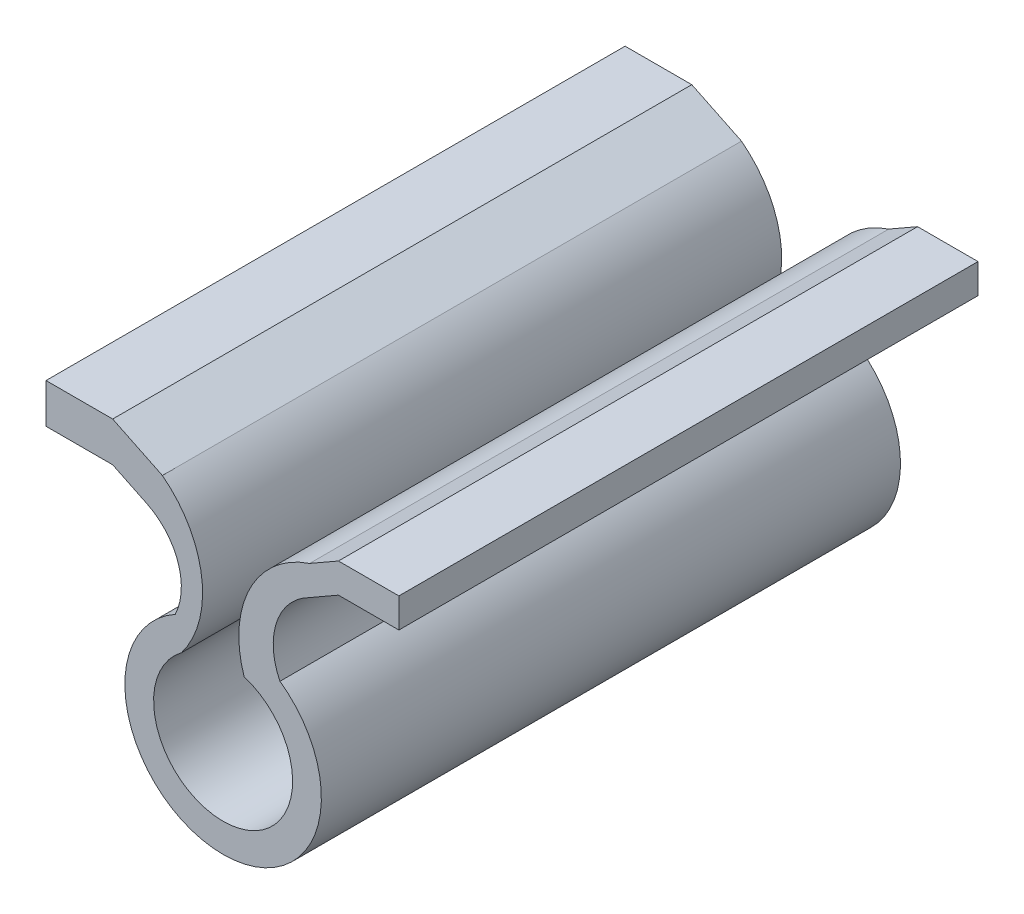
ISO-10303-21;
HEADER;
FILE_DESCRIPTION(('STEP AP214'),'2;1');
FILE_NAME('part.step','',(''),(''),'','','');
FILE_SCHEMA(('AUTOMOTIVE_DESIGN { 1 0 10303 214 1 1 1 1 }'));
ENDSEC;
DATA;
#1=APPLICATION_CONTEXT('core data for automotive mechanical design processes');
#2=APPLICATION_PROTOCOL_DEFINITION('international standard','automotive_design',2000,#1);
#3=PRODUCT_CONTEXT('',#1,'mechanical');
#4=PRODUCT('Part','Part','',(#3));
#5=PRODUCT_RELATED_PRODUCT_CATEGORY('part','',(#4));
#6=PRODUCT_DEFINITION_FORMATION('','',#4);
#7=PRODUCT_DEFINITION_CONTEXT('part definition',#1,'design');
#8=PRODUCT_DEFINITION('design','',#6,#7);
#9=PRODUCT_DEFINITION_SHAPE('','',#8);
#10=(LENGTH_UNIT() NAMED_UNIT(*) SI_UNIT(.MILLI.,.METRE.));
#11=(NAMED_UNIT(*) PLANE_ANGLE_UNIT() SI_UNIT($,.RADIAN.));
#12=(NAMED_UNIT(*) SI_UNIT($,.STERADIAN.) SOLID_ANGLE_UNIT());
#13=UNCERTAINTY_MEASURE_WITH_UNIT(LENGTH_MEASURE(1.E-05),#10,'distance_accuracy_value','');
#14=(GEOMETRIC_REPRESENTATION_CONTEXT(3) GLOBAL_UNCERTAINTY_ASSIGNED_CONTEXT((#13)) GLOBAL_UNIT_ASSIGNED_CONTEXT((#10,
#11,#12)) REPRESENTATION_CONTEXT('',''));
#15=CARTESIAN_POINT('',(0.,0.,0.));
#16=DIRECTION('',(0.,0.,1.));
#17=DIRECTION('',(1.,0.,0.));
#18=AXIS2_PLACEMENT_3D('',#15,#16,#17);
#19=CARTESIAN_POINT('',(-8.88655130802886,9.70742429222513,-50.));
#20=DIRECTION('',(0.,0.,1.));
#21=DIRECTION('',(1.,0.,0.));
#22=AXIS2_PLACEMENT_3D('',#19,#20,#21);
#23=CYLINDRICAL_SURFACE('',#22,5.27994745300308);
#24=CARTESIAN_POINT('',(-8.88655130802886,9.70742429222513,0.));
#25=DIRECTION('',(0.,0.,-1.));
#26=DIRECTION('',(1.,0.,0.));
#27=AXIS2_PLACEMENT_3D('',#24,#25,#26);
#28=CIRCLE('',#27,5.27994745300308);
#29=CARTESIAN_POINT('',(-6.58660829445862,14.4601190268786,0.));
#30=VERTEX_POINT('',#29);
#31=CARTESIAN_POINT('',(-4.13385657337527,7.40748127865506,0.));
#32=VERTEX_POINT('',#31);
#33=EDGE_CURVE('E178',#30,#32,#28,.T.);
#34=ORIENTED_EDGE('',*,*,#33,.F.);
#35=DIRECTION('',(0.,0.,1.));
#36=VECTOR('',#35,1.);
#37=CARTESIAN_POINT('',(-6.58660829445862,14.4601190268786,-50.));
#38=LINE('',#37,#36);
#39=CARTESIAN_POINT('',(-6.58660829445862,14.4601190268786,-50.));
#40=VERTEX_POINT('',#39);
#41=EDGE_CURVE('E11',#40,#30,#38,.T.);
#42=ORIENTED_EDGE('',*,*,#41,.F.);
#43=CARTESIAN_POINT('',(-8.88655130802886,9.70742429222513,-50.));
#44=DIRECTION('',(0.,0.,-1.));
#45=DIRECTION('',(1.,0.,0.));
#46=AXIS2_PLACEMENT_3D('',#43,#44,#45);
#47=CIRCLE('',#46,5.27994745300308);
#48=CARTESIAN_POINT('',(-4.13385657337527,7.40748127865506,-50.));
#49=VERTEX_POINT('',#48);
#50=EDGE_CURVE('E222',#40,#49,#47,.T.);
#51=ORIENTED_EDGE('',*,*,#50,.T.);
#52=DIRECTION('',(0.,0.,1.));
#53=VECTOR('',#52,1.);
#54=CARTESIAN_POINT('',(-4.13385657337527,7.40748127865506,-50.));
#55=LINE('',#54,#53);
#56=EDGE_CURVE('E36',#49,#32,#55,.T.);
#57=ORIENTED_EDGE('',*,*,#56,.T.);
#58=EDGE_LOOP('',(#34,#42,#51,#57));
#59=FACE_BOUND('',#58,.T.);
#60=ADVANCED_FACE('F33',(#59),#23,.F.);
#61=CARTESIAN_POINT('',(-6.58660829445862,14.4601190268786,-50.));
#62=DIRECTION('',(-0.435599602844931,-0.90014053680597,0.));
#63=DIRECTION('',(0.90014053680597,-0.435599602844931,0.));
#64=AXIS2_PLACEMENT_3D('',#61,#62,#63);
#65=PLANE('',#64);
#66=DIRECTION('',(0.90014053680597,-0.435599602844931,0.));
#67=VECTOR('',#66,1.);
#68=CARTESIAN_POINT('',(-6.58660829445862,14.4601190268786,0.));
#69=LINE('',#68,#67);
#70=CARTESIAN_POINT('',(-9.53478421620011,15.8868120910356,0.));
#71=VERTEX_POINT('',#70);
#72=EDGE_CURVE('E220',#71,#30,#69,.T.);
#73=ORIENTED_EDGE('',*,*,#72,.F.);
#74=DIRECTION('',(0.,0.,1.));
#75=VECTOR('',#74,1.);
#76=CARTESIAN_POINT('',(-9.53478421620011,15.8868120910356,-50.));
#77=LINE('',#76,#75);
#78=CARTESIAN_POINT('',(-9.53478421620011,15.8868120910356,-50.));
#79=VERTEX_POINT('',#78);
#80=EDGE_CURVE('E42',#79,#71,#77,.T.);
#81=ORIENTED_EDGE('',*,*,#80,.F.);
#82=DIRECTION('',(0.90014053680597,-0.435599602844931,0.));
#83=VECTOR('',#82,1.);
#84=CARTESIAN_POINT('',(-6.58660829445862,14.4601190268786,-50.));
#85=LINE('',#84,#83);
#86=EDGE_CURVE('E168',#79,#40,#85,.T.);
#87=ORIENTED_EDGE('',*,*,#86,.T.);
#88=ORIENTED_EDGE('',*,*,#41,.T.);
#89=EDGE_LOOP('',(#73,#81,#87,#88));
#90=FACE_BOUND('',#89,.T.);
#91=ADVANCED_FACE('F250',(#90),#65,.T.);
#92=CARTESIAN_POINT('',(-9.53478421620011,15.8868120910356,-50.));
#93=DIRECTION('',(0.,-1.,0.));
#94=DIRECTION('',(0.,0.,-1.));
#95=AXIS2_PLACEMENT_3D('',#92,#93,#94);
#96=PLANE('',#95);
#97=DIRECTION('',(1.,0.,0.));
#98=VECTOR('',#97,1.);
#99=CARTESIAN_POINT('',(-9.53478421620011,15.8868120910356,0.));
#100=LINE('',#99,#98);
#101=CARTESIAN_POINT('',(-15.2917008969375,15.8868120910356,0.));
#102=VERTEX_POINT('',#101);
#103=EDGE_CURVE('E155',#102,#71,#100,.T.);
#104=ORIENTED_EDGE('',*,*,#103,.F.);
#105=DIRECTION('',(0.,0.,1.));
#106=VECTOR('',#105,1.);
#107=CARTESIAN_POINT('',(-15.2917008969375,15.8868120910356,-50.));
#108=LINE('',#107,#106);
#109=CARTESIAN_POINT('',(-15.2917008969375,15.8868120910356,-50.));
#110=VERTEX_POINT('',#109);
#111=EDGE_CURVE('E150',#110,#102,#108,.T.);
#112=ORIENTED_EDGE('',*,*,#111,.F.);
#113=DIRECTION('',(1.,0.,0.));
#114=VECTOR('',#113,1.);
#115=CARTESIAN_POINT('',(-9.53478421620011,15.8868120910356,-50.));
#116=LINE('',#115,#114);
#117=EDGE_CURVE('E153',#110,#79,#116,.T.);
#118=ORIENTED_EDGE('',*,*,#117,.T.);
#119=ORIENTED_EDGE('',*,*,#80,.T.);
#120=EDGE_LOOP('',(#104,#112,#118,#119));
#121=FACE_BOUND('',#120,.T.);
#122=ADVANCED_FACE('F152',(#121),#96,.T.);
#123=CARTESIAN_POINT('',(-15.2917008969375,15.8868120910356,-50.));
#124=DIRECTION('',(-1.,0.,0.));
#125=DIRECTION('',(0.,0.,1.));
#126=AXIS2_PLACEMENT_3D('',#123,#124,#125);
#127=PLANE('',#126);
#128=DIRECTION('',(0.,-1.,0.));
#129=VECTOR('',#128,1.);
#130=CARTESIAN_POINT('',(-15.2917008969375,15.8868120910356,0.));
#131=LINE('',#130,#129);
#132=CARTESIAN_POINT('',(-15.2917008969375,19.3100991911169,0.));
#133=VERTEX_POINT('',#132);
#134=EDGE_CURVE('E217',#133,#102,#131,.T.);
#135=ORIENTED_EDGE('',*,*,#134,.F.);
#136=DIRECTION('',(0.,0.,1.));
#137=VECTOR('',#136,1.);
#138=CARTESIAN_POINT('',(-15.2917008969375,19.3100991911169,-50.));
#139=LINE('',#138,#137);
#140=CARTESIAN_POINT('',(-15.2917008969375,19.3100991911169,-50.));
#141=VERTEX_POINT('',#140);
#142=EDGE_CURVE('E160',#141,#133,#139,.T.);
#143=ORIENTED_EDGE('',*,*,#142,.F.);
#144=DIRECTION('',(0.,-1.,0.));
#145=VECTOR('',#144,1.);
#146=CARTESIAN_POINT('',(-15.2917008969375,15.8868120910356,-50.));
#147=LINE('',#146,#145);
#148=EDGE_CURVE('E166',#141,#110,#147,.T.);
#149=ORIENTED_EDGE('',*,*,#148,.T.);
#150=ORIENTED_EDGE('',*,*,#111,.T.);
#151=EDGE_LOOP('',(#135,#143,#149,#150));
#152=FACE_BOUND('',#151,.T.);
#153=ADVANCED_FACE('F170',(#152),#127,.T.);
#154=CARTESIAN_POINT('',(-15.2917008969375,19.3100991911169,-50.));
#155=DIRECTION('',(0.,1.,0.));
#156=DIRECTION('',(0.,0.,1.));
#157=AXIS2_PLACEMENT_3D('',#154,#155,#156);
#158=PLANE('',#157);
#159=DIRECTION('',(-1.,0.,0.));
#160=VECTOR('',#159,1.);
#161=CARTESIAN_POINT('',(-15.2917008969375,19.3100991911169,0.));
#162=LINE('',#161,#160);
#163=CARTESIAN_POINT('',(-9.53478421620011,19.3100991911169,0.));
#164=VERTEX_POINT('',#163);
#165=EDGE_CURVE('E214',#164,#133,#162,.T.);
#166=ORIENTED_EDGE('',*,*,#165,.F.);
#167=DIRECTION('',(0.,0.,1.));
#168=VECTOR('',#167,1.);
#169=CARTESIAN_POINT('',(-9.53478421620011,19.3100991911169,-50.));
#170=LINE('',#169,#168);
#171=CARTESIAN_POINT('',(-9.53478421620011,19.3100991911169,-50.));
#172=VERTEX_POINT('',#171);
#173=EDGE_CURVE('E226',#172,#164,#170,.T.);
#174=ORIENTED_EDGE('',*,*,#173,.F.);
#175=DIRECTION('',(-1.,0.,0.));
#176=VECTOR('',#175,1.);
#177=CARTESIAN_POINT('',(-15.2917008969375,19.3100991911169,-50.));
#178=LINE('',#177,#176);
#179=EDGE_CURVE('E171',#172,#141,#178,.T.);
#180=ORIENTED_EDGE('',*,*,#179,.T.);
#181=ORIENTED_EDGE('',*,*,#142,.T.);
#182=EDGE_LOOP('',(#166,#174,#180,#181));
#183=FACE_BOUND('',#182,.T.);
#184=ADVANCED_FACE('F263',(#183),#158,.T.);
#185=CARTESIAN_POINT('',(-9.53478421620011,19.3100991911169,-50.));
#186=DIRECTION('',(0.43559960284493,0.90014053680597,0.));
#187=DIRECTION('',(-0.90014053680597,0.43559960284493,0.));
#188=AXIS2_PLACEMENT_3D('',#185,#186,#187);
#189=PLANE('',#188);
#190=DIRECTION('',(-0.90014053680597,0.43559960284493,0.));
#191=VECTOR('',#190,1.);
#192=CARTESIAN_POINT('',(-9.53478421620011,19.3100991911169,0.));
#193=LINE('',#192,#191);
#194=CARTESIAN_POINT('',(-5.24433447733515,17.2338476216594,0.));
#195=VERTEX_POINT('',#194);
#196=EDGE_CURVE('E211',#195,#164,#193,.T.);
#197=ORIENTED_EDGE('',*,*,#196,.F.);
#198=DIRECTION('',(0.,0.,1.));
#199=VECTOR('',#198,1.);
#200=CARTESIAN_POINT('',(-5.24433447733515,17.2338476216594,-50.));
#201=LINE('',#200,#199);
#202=CARTESIAN_POINT('',(-5.24433447733515,17.2338476216594,-50.));
#203=VERTEX_POINT('',#202);
#204=EDGE_CURVE('E228',#203,#195,#201,.T.);
#205=ORIENTED_EDGE('',*,*,#204,.F.);
#206=DIRECTION('',(-0.90014053680597,0.43559960284493,0.));
#207=VECTOR('',#206,1.);
#208=CARTESIAN_POINT('',(-9.53478421620011,19.3100991911169,-50.));
#209=LINE('',#208,#207);
#210=EDGE_CURVE('E173',#203,#172,#209,.T.);
#211=ORIENTED_EDGE('',*,*,#210,.T.);
#212=ORIENTED_EDGE('',*,*,#173,.T.);
#213=EDGE_LOOP('',(#197,#205,#211,#212));
#214=FACE_BOUND('',#213,.T.);
#215=ADVANCED_FACE('F266',(#214),#189,.T.);
#216=CARTESIAN_POINT('',(-10.6448729753776,10.1955785013076,-50.));
#217=DIRECTION('',(0.,0.,1.));
#218=DIRECTION('',(1.,0.,0.));
#219=AXIS2_PLACEMENT_3D('',#216,#217,#218);
#220=CYLINDRICAL_SURFACE('',#219,8.87147385045668);
#221=CARTESIAN_POINT('',(-10.6448729753776,10.1955785013076,0.));
#222=DIRECTION('',(0.,0.,1.));
#223=DIRECTION('',(-1.,0.,0.));
#224=AXIS2_PLACEMENT_3D('',#221,#222,#223);
#225=CIRCLE('',#224,8.87147385045668);
#226=CARTESIAN_POINT('',(-3.60660385502578,4.79504000326516,0.));
#227=VERTEX_POINT('',#226);
#228=EDGE_CURVE('E208',#227,#195,#225,.T.);
#229=ORIENTED_EDGE('',*,*,#228,.F.);
#230=DIRECTION('',(0.,0.,1.));
#231=VECTOR('',#230,1.);
#232=CARTESIAN_POINT('',(-3.60660385502578,4.79504000326516,-50.));
#233=LINE('',#232,#231);
#234=CARTESIAN_POINT('',(-3.60660385502578,4.79504000326516,-50.));
#235=VERTEX_POINT('',#234);
#236=EDGE_CURVE('E230',#235,#227,#233,.T.);
#237=ORIENTED_EDGE('',*,*,#236,.F.);
#238=CARTESIAN_POINT('',(-10.6448729753776,10.1955785013076,-50.));
#239=DIRECTION('',(0.,0.,1.));
#240=DIRECTION('',(-1.,0.,0.));
#241=AXIS2_PLACEMENT_3D('',#238,#239,#240);
#242=CIRCLE('',#241,8.87147385045668);
#243=EDGE_CURVE('E447',#235,#203,#242,.T.);
#244=ORIENTED_EDGE('',*,*,#243,.T.);
#245=ORIENTED_EDGE('',*,*,#204,.T.);
#246=EDGE_LOOP('',(#229,#237,#244,#245));
#247=FACE_BOUND('',#246,.T.);
#248=ADVANCED_FACE('F270',(#247),#220,.T.);
#249=CARTESIAN_POINT('',(0.,0.,-50.));
#250=DIRECTION('',(0.,0.,1.));
#251=DIRECTION('',(1.,0.,0.));
#252=AXIS2_PLACEMENT_3D('',#249,#250,#251);
#253=CYLINDRICAL_SURFACE('',#252,6.);
#254=CARTESIAN_POINT('',(0.,0.,0.));
#255=DIRECTION('',(0.,0.,-1.));
#256=DIRECTION('',(1.,0.,0.));
#257=AXIS2_PLACEMENT_3D('',#254,#255,#256);
#258=CIRCLE('',#257,6.);
#259=CARTESIAN_POINT('',(1.81186461489304,5.71989043752575,0.));
#260=VERTEX_POINT('',#259);
#261=EDGE_CURVE('E205',#260,#227,#258,.T.);
#262=ORIENTED_EDGE('',*,*,#261,.F.);
#263=DIRECTION('',(0.,0.,1.));
#264=VECTOR('',#263,1.);
#265=CARTESIAN_POINT('',(1.81186461489304,5.71989043752575,-50.));
#266=LINE('',#265,#264);
#267=CARTESIAN_POINT('',(1.81186461489304,5.71989043752575,-50.));
#268=VERTEX_POINT('',#267);
#269=EDGE_CURVE('E232',#268,#260,#266,.T.);
#270=ORIENTED_EDGE('',*,*,#269,.F.);
#271=CARTESIAN_POINT('',(0.,0.,-50.));
#272=DIRECTION('',(0.,0.,-1.));
#273=DIRECTION('',(1.,0.,0.));
#274=AXIS2_PLACEMENT_3D('',#271,#272,#273);
#275=CIRCLE('',#274,6.);
#276=EDGE_CURVE('E443',#268,#235,#275,.T.);
#277=ORIENTED_EDGE('',*,*,#276,.T.);
#278=ORIENTED_EDGE('',*,*,#236,.T.);
#279=EDGE_LOOP('',(#262,#270,#277,#278));
#280=FACE_BOUND('',#279,.T.);
#281=ADVANCED_FACE('F274',(#280),#253,.F.);
#282=CARTESIAN_POINT('',(10.2853846896685,8.53937679193668,-50.));
#283=DIRECTION('',(0.,0.,1.));
#284=DIRECTION('',(1.,0.,0.));
#285=AXIS2_PLACEMENT_3D('',#282,#283,#284);
#286=CYLINDRICAL_SURFACE('',#285,8.93028811183223);
#287=CARTESIAN_POINT('',(10.2853846896685,8.53937679193668,0.));
#288=DIRECTION('',(0.,0.,1.));
#289=DIRECTION('',(1.,0.,0.));
#290=AXIS2_PLACEMENT_3D('',#287,#288,#289);
#291=CIRCLE('',#290,8.93028811183223);
#292=CARTESIAN_POINT('',(7.46589833525728,17.012896866712,0.));
#293=VERTEX_POINT('',#292);
#294=EDGE_CURVE('E202',#293,#260,#291,.T.);
#295=ORIENTED_EDGE('',*,*,#294,.F.);
#296=DIRECTION('',(0.,0.,1.));
#297=VECTOR('',#296,1.);
#298=CARTESIAN_POINT('',(7.46589833525728,17.012896866712,-50.));
#299=LINE('',#298,#297);
#300=CARTESIAN_POINT('',(7.46589833525728,17.012896866712,-50.));
#301=VERTEX_POINT('',#300);
#302=EDGE_CURVE('E234',#301,#293,#299,.T.);
#303=ORIENTED_EDGE('',*,*,#302,.F.);
#304=CARTESIAN_POINT('',(10.2853846896685,8.53937679193668,-50.));
#305=DIRECTION('',(0.,0.,1.));
#306=DIRECTION('',(1.,0.,0.));
#307=AXIS2_PLACEMENT_3D('',#304,#305,#306);
#308=CIRCLE('',#307,8.93028811183223);
#309=EDGE_CURVE('E454',#301,#268,#308,.T.);
#310=ORIENTED_EDGE('',*,*,#309,.T.);
#311=ORIENTED_EDGE('',*,*,#269,.T.);
#312=EDGE_LOOP('',(#295,#303,#310,#311));
#313=FACE_BOUND('',#312,.T.);
#314=ADVANCED_FACE('F278',(#313),#286,.T.);
#315=CARTESIAN_POINT('',(9.95662893744976,18.439589930869,-50.));
#316=DIRECTION('',(-0.49703644842418,0.867729663511556,0.));
#317=DIRECTION('',(-0.867729663511556,-0.49703644842418,0.));
#318=AXIS2_PLACEMENT_3D('',#315,#316,#317);
#319=PLANE('',#318);
#320=DIRECTION('',(-0.867729663511555,-0.49703644842418,0.));
#321=VECTOR('',#320,1.);
#322=CARTESIAN_POINT('',(9.95662893744976,18.439589930869,0.));
#323=LINE('',#322,#321);
#324=CARTESIAN_POINT('',(9.95662893744976,18.439589930869,0.));
#325=VERTEX_POINT('',#324);
#326=EDGE_CURVE('E199',#325,#293,#323,.T.);
#327=ORIENTED_EDGE('',*,*,#326,.F.);
#328=DIRECTION('',(0.,0.,1.));
#329=VECTOR('',#328,1.);
#330=CARTESIAN_POINT('',(9.95662893744976,18.439589930869,-50.));
#331=LINE('',#330,#329);
#332=CARTESIAN_POINT('',(9.95662893744976,18.439589930869,-50.));
#333=VERTEX_POINT('',#332);
#334=EDGE_CURVE('E236',#333,#325,#331,.T.);
#335=ORIENTED_EDGE('',*,*,#334,.F.);
#336=DIRECTION('',(-0.867729663511555,-0.49703644842418,0.));
#337=VECTOR('',#336,1.);
#338=CARTESIAN_POINT('',(9.95662893744976,18.439589930869,-50.));
#339=LINE('',#338,#337);
#340=EDGE_CURVE('E436',#333,#301,#339,.T.);
#341=ORIENTED_EDGE('',*,*,#340,.T.);
#342=ORIENTED_EDGE('',*,*,#302,.T.);
#343=EDGE_LOOP('',(#327,#335,#341,#342));
#344=FACE_BOUND('',#343,.T.);
#345=ADVANCED_FACE('F282',(#344),#319,.T.);
#346=CARTESIAN_POINT('',(15.1761232117386,18.439589930869,-50.));
#347=DIRECTION('',(0.,1.,0.));
#348=DIRECTION('',(0.,0.,1.));
#349=AXIS2_PLACEMENT_3D('',#346,#347,#348);
#350=PLANE('',#349);
#351=DIRECTION('',(-1.,0.,0.));
#352=VECTOR('',#351,1.);
#353=CARTESIAN_POINT('',(15.1761232117386,18.439589930869,0.));
#354=LINE('',#353,#352);
#355=CARTESIAN_POINT('',(15.1761232117386,18.439589930869,0.));
#356=VERTEX_POINT('',#355);
#357=EDGE_CURVE('E196',#356,#325,#354,.T.);
#358=ORIENTED_EDGE('',*,*,#357,.F.);
#359=DIRECTION('',(0.,0.,1.));
#360=VECTOR('',#359,1.);
#361=CARTESIAN_POINT('',(15.1761232117386,18.439589930869,-50.));
#362=LINE('',#361,#360);
#363=CARTESIAN_POINT('',(15.1761232117386,18.439589930869,-50.));
#364=VERTEX_POINT('',#363);
#365=EDGE_CURVE('E238',#364,#356,#362,.T.);
#366=ORIENTED_EDGE('',*,*,#365,.F.);
#367=DIRECTION('',(-1.,0.,0.));
#368=VECTOR('',#367,1.);
#369=CARTESIAN_POINT('',(15.1761232117386,18.439589930869,-50.));
#370=LINE('',#369,#368);
#371=EDGE_CURVE('E432',#364,#333,#370,.T.);
#372=ORIENTED_EDGE('',*,*,#371,.T.);
#373=ORIENTED_EDGE('',*,*,#334,.T.);
#374=EDGE_LOOP('',(#358,#366,#372,#373));
#375=FACE_BOUND('',#374,.T.);
#376=ADVANCED_FACE('F286',(#375),#350,.T.);
#377=CARTESIAN_POINT('',(15.1761232117386,15.8868120910356,-50.));
#378=DIRECTION('',(1.,0.,0.));
#379=DIRECTION('',(0.,0.,-1.));
#380=AXIS2_PLACEMENT_3D('',#377,#378,#379);
#381=PLANE('',#380);
#382=DIRECTION('',(0.,1.,0.));
#383=VECTOR('',#382,1.);
#384=CARTESIAN_POINT('',(15.1761232117386,15.8868120910356,0.));
#385=LINE('',#384,#383);
#386=CARTESIAN_POINT('',(15.1761232117386,15.8868120910356,0.));
#387=VERTEX_POINT('',#386);
#388=EDGE_CURVE('E193',#387,#356,#385,.T.);
#389=ORIENTED_EDGE('',*,*,#388,.F.);
#390=DIRECTION('',(0.,0.,1.));
#391=VECTOR('',#390,1.);
#392=CARTESIAN_POINT('',(15.1761232117386,15.8868120910356,-50.));
#393=LINE('',#392,#391);
#394=CARTESIAN_POINT('',(15.1761232117386,15.8868120910356,-50.));
#395=VERTEX_POINT('',#394);
#396=EDGE_CURVE('E240',#395,#387,#393,.T.);
#397=ORIENTED_EDGE('',*,*,#396,.F.);
#398=DIRECTION('',(0.,1.,0.));
#399=VECTOR('',#398,1.);
#400=CARTESIAN_POINT('',(15.1761232117386,15.8868120910356,-50.));
#401=LINE('',#400,#399);
#402=EDGE_CURVE('E458',#395,#364,#401,.T.);
#403=ORIENTED_EDGE('',*,*,#402,.T.);
#404=ORIENTED_EDGE('',*,*,#365,.T.);
#405=EDGE_LOOP('',(#389,#397,#403,#404));
#406=FACE_BOUND('',#405,.T.);
#407=ADVANCED_FACE('F290',(#406),#381,.T.);
#408=CARTESIAN_POINT('',(9.95662893744976,15.8868120910356,-50.));
#409=DIRECTION('',(0.,-1.,0.));
#410=DIRECTION('',(0.,0.,-1.));
#411=AXIS2_PLACEMENT_3D('',#408,#409,#410);
#412=PLANE('',#411);
#413=DIRECTION('',(1.,0.,0.));
#414=VECTOR('',#413,1.);
#415=CARTESIAN_POINT('',(9.95662893744976,15.8868120910356,0.));
#416=LINE('',#415,#414);
#417=CARTESIAN_POINT('',(9.95662893744976,15.8868120910356,0.));
#418=VERTEX_POINT('',#417);
#419=EDGE_CURVE('E190',#418,#387,#416,.T.);
#420=ORIENTED_EDGE('',*,*,#419,.F.);
#421=DIRECTION('',(0.,0.,1.));
#422=VECTOR('',#421,1.);
#423=CARTESIAN_POINT('',(9.95662893744976,15.8868120910356,-50.));
#424=LINE('',#423,#422);
#425=CARTESIAN_POINT('',(9.95662893744976,15.8868120910356,-50.));
#426=VERTEX_POINT('',#425);
#427=EDGE_CURVE('E242',#426,#418,#424,.T.);
#428=ORIENTED_EDGE('',*,*,#427,.F.);
#429=DIRECTION('',(1.,0.,0.));
#430=VECTOR('',#429,1.);
#431=CARTESIAN_POINT('',(9.95662893744976,15.8868120910356,-50.));
#432=LINE('',#431,#430);
#433=EDGE_CURVE('E425',#426,#395,#432,.T.);
#434=ORIENTED_EDGE('',*,*,#433,.T.);
#435=ORIENTED_EDGE('',*,*,#396,.T.);
#436=EDGE_LOOP('',(#420,#428,#434,#435));
#437=FACE_BOUND('',#436,.T.);
#438=ADVANCED_FACE('F294',(#437),#412,.T.);
#439=CARTESIAN_POINT('',(7.46589833525728,14.4601190268786,-50.));
#440=DIRECTION('',(0.49703644842418,-0.867729663511556,0.));
#441=DIRECTION('',(0.867729663511556,0.49703644842418,0.));
#442=AXIS2_PLACEMENT_3D('',#439,#440,#441);
#443=PLANE('',#442);
#444=DIRECTION('',(0.867729663511555,0.49703644842418,0.));
#445=VECTOR('',#444,1.);
#446=CARTESIAN_POINT('',(7.46589833525728,14.4601190268786,0.));
#447=LINE('',#446,#445);
#448=CARTESIAN_POINT('',(7.46589833525728,14.4601190268786,0.));
#449=VERTEX_POINT('',#448);
#450=EDGE_CURVE('E187',#449,#418,#447,.T.);
#451=ORIENTED_EDGE('',*,*,#450,.F.);
#452=DIRECTION('',(0.,0.,1.));
#453=VECTOR('',#452,1.);
#454=CARTESIAN_POINT('',(7.46589833525728,14.4601190268786,-50.));
#455=LINE('',#454,#453);
#456=CARTESIAN_POINT('',(7.46589833525728,14.4601190268786,-50.));
#457=VERTEX_POINT('',#456);
#458=EDGE_CURVE('E244',#457,#449,#455,.T.);
#459=ORIENTED_EDGE('',*,*,#458,.F.);
#460=DIRECTION('',(0.867729663511555,0.49703644842418,0.));
#461=VECTOR('',#460,1.);
#462=CARTESIAN_POINT('',(7.46589833525728,14.4601190268786,-50.));
#463=LINE('',#462,#461);
#464=EDGE_CURVE('E421',#457,#426,#463,.T.);
#465=ORIENTED_EDGE('',*,*,#464,.T.);
#466=ORIENTED_EDGE('',*,*,#427,.T.);
#467=EDGE_LOOP('',(#451,#459,#465,#466));
#468=FACE_BOUND('',#467,.T.);
#469=ADVANCED_FACE('F298',(#468),#443,.T.);
#470=CARTESIAN_POINT('',(9.95662893744976,9.41039829271164,-50.));
#471=DIRECTION('',(0.,0.,1.));
#472=DIRECTION('',(1.,0.,0.));
#473=AXIS2_PLACEMENT_3D('',#470,#471,#472);
#474=CYLINDRICAL_SURFACE('',#473,5.63057887128617);
#475=CARTESIAN_POINT('',(9.95662893744976,9.41039829271164,0.));
#476=DIRECTION('',(0.,0.,-1.));
#477=DIRECTION('',(-1.,0.,0.));
#478=AXIS2_PLACEMENT_3D('',#475,#476,#477);
#479=CIRCLE('',#478,5.63057887128617);
#480=CARTESIAN_POINT('',(4.90690820327153,6.91966769054192,0.));
#481=VERTEX_POINT('',#480);
#482=EDGE_CURVE('E184',#481,#449,#479,.T.);
#483=ORIENTED_EDGE('',*,*,#482,.F.);
#484=DIRECTION('',(0.,0.,1.));
#485=VECTOR('',#484,1.);
#486=CARTESIAN_POINT('',(4.90690820327153,6.91966769054192,-50.));
#487=LINE('',#486,#485);
#488=CARTESIAN_POINT('',(4.90690820327153,6.91966769054192,-50.));
#489=VERTEX_POINT('',#488);
#490=EDGE_CURVE('E245',#489,#481,#487,.T.);
#491=ORIENTED_EDGE('',*,*,#490,.F.);
#492=CARTESIAN_POINT('',(9.95662893744976,9.41039829271164,-50.));
#493=DIRECTION('',(0.,0.,-1.));
#494=DIRECTION('',(-1.,0.,0.));
#495=AXIS2_PLACEMENT_3D('',#492,#493,#494);
#496=CIRCLE('',#495,5.63057887128617);
#497=EDGE_CURVE('E462',#489,#457,#496,.T.);
#498=ORIENTED_EDGE('',*,*,#497,.T.);
#499=ORIENTED_EDGE('',*,*,#458,.T.);
#500=EDGE_LOOP('',(#483,#491,#498,#499));
#501=FACE_BOUND('',#500,.T.);
#502=ADVANCED_FACE('F302',(#501),#474,.F.);
#503=CARTESIAN_POINT('',(0.,0.,-50.));
#504=DIRECTION('',(0.,0.,1.));
#505=DIRECTION('',(1.,0.,0.));
#506=AXIS2_PLACEMENT_3D('',#503,#504,#505);
#507=CYLINDRICAL_SURFACE('',#506,8.48289744502804);
#508=CARTESIAN_POINT('',(0.,0.,0.));
#509=DIRECTION('',(0.,0.,1.));
#510=DIRECTION('',(1.,0.,0.));
#511=AXIS2_PLACEMENT_3D('',#508,#509,#510);
#512=CIRCLE('',#511,8.48289744502804);
#513=EDGE_CURVE('E181',#32,#481,#512,.T.);
#514=ORIENTED_EDGE('',*,*,#513,.F.);
#515=ORIENTED_EDGE('',*,*,#56,.F.);
#516=CARTESIAN_POINT('',(0.,0.,-50.));
#517=DIRECTION('',(0.,0.,1.));
#518=DIRECTION('',(1.,0.,0.));
#519=AXIS2_PLACEMENT_3D('',#516,#517,#518);
#520=CIRCLE('',#519,8.48289744502804);
#521=EDGE_CURVE('E464',#49,#489,#520,.T.);
#522=ORIENTED_EDGE('',*,*,#521,.T.);
#523=ORIENTED_EDGE('',*,*,#490,.T.);
#524=EDGE_LOOP('',(#514,#515,#522,#523));
#525=FACE_BOUND('',#524,.T.);
#526=ADVANCED_FACE('F247',(#525),#507,.T.);
#527=CARTESIAN_POINT('',(-8.88655130802886,9.70742429222513,-50.));
#528=DIRECTION('',(0.,0.,1.));
#529=DIRECTION('',(1.,0.,0.));
#530=AXIS2_PLACEMENT_3D('',#527,#528,#529);
#531=PLANE('',#530);
#532=ORIENTED_EDGE('',*,*,#50,.F.);
#533=ORIENTED_EDGE('',*,*,#86,.F.);
#534=ORIENTED_EDGE('',*,*,#117,.F.);
#535=ORIENTED_EDGE('',*,*,#148,.F.);
#536=ORIENTED_EDGE('',*,*,#179,.F.);
#537=ORIENTED_EDGE('',*,*,#210,.F.);
#538=ORIENTED_EDGE('',*,*,#243,.F.);
#539=ORIENTED_EDGE('',*,*,#276,.F.);
#540=ORIENTED_EDGE('',*,*,#309,.F.);
#541=ORIENTED_EDGE('',*,*,#340,.F.);
#542=ORIENTED_EDGE('',*,*,#371,.F.);
#543=ORIENTED_EDGE('',*,*,#402,.F.);
#544=ORIENTED_EDGE('',*,*,#433,.F.);
#545=ORIENTED_EDGE('',*,*,#464,.F.);
#546=ORIENTED_EDGE('',*,*,#497,.F.);
#547=ORIENTED_EDGE('',*,*,#521,.F.);
#548=EDGE_LOOP('',(#532,#533,#534,#535,#536,#537,#538,#539,#540,#541,#542,#543,#544,#545,#546,#547));
#549=FACE_BOUND('',#548,.T.);
#550=ADVANCED_FACE('F164',(#549),#531,.F.);
#551=CARTESIAN_POINT('',(-8.88655130802886,9.70742429222513,0.));
#552=DIRECTION('',(0.,0.,1.));
#553=DIRECTION('',(1.,0.,0.));
#554=AXIS2_PLACEMENT_3D('',#551,#552,#553);
#555=PLANE('',#554);
#556=ORIENTED_EDGE('',*,*,#33,.T.);
#557=ORIENTED_EDGE('',*,*,#513,.T.);
#558=ORIENTED_EDGE('',*,*,#482,.T.);
#559=ORIENTED_EDGE('',*,*,#450,.T.);
#560=ORIENTED_EDGE('',*,*,#419,.T.);
#561=ORIENTED_EDGE('',*,*,#388,.T.);
#562=ORIENTED_EDGE('',*,*,#357,.T.);
#563=ORIENTED_EDGE('',*,*,#326,.T.);
#564=ORIENTED_EDGE('',*,*,#294,.T.);
#565=ORIENTED_EDGE('',*,*,#261,.T.);
#566=ORIENTED_EDGE('',*,*,#228,.T.);
#567=ORIENTED_EDGE('',*,*,#196,.T.);
#568=ORIENTED_EDGE('',*,*,#165,.T.);
#569=ORIENTED_EDGE('',*,*,#134,.T.);
#570=ORIENTED_EDGE('',*,*,#103,.T.);
#571=ORIENTED_EDGE('',*,*,#72,.T.);
#572=EDGE_LOOP('',(#556,#557,#558,#559,#560,#561,#562,#563,#564,#565,#566,#567,#568,#569,#570,#571));
#573=FACE_BOUND('',#572,.T.);
#574=ADVANCED_FACE('F249',(#573),#555,.T.);
#575=CLOSED_SHELL('',(#60,#91,#122,#153,#184,#215,#248,#281,#314,#345,#376,#407,#438,#469,#502,
#526,#550,#574));
#576=MANIFOLD_SOLID_BREP('B2',#575);
#577=ADVANCED_BREP_SHAPE_REPRESENTATION('',(#18,#576),#14);
#578=SHAPE_DEFINITION_REPRESENTATION(#9,#577);
ENDSEC;
END-ISO-10303-21;
